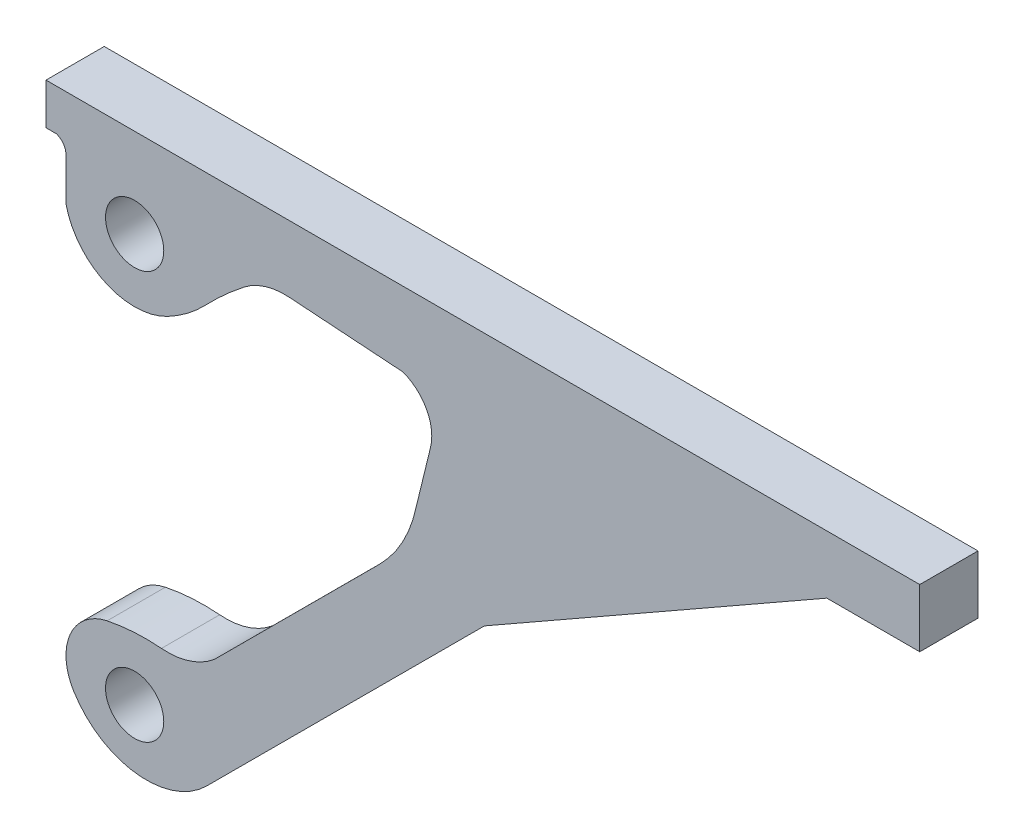
ISO-10303-21;
HEADER;
FILE_DESCRIPTION(('STEP AP214'),'2;1');
FILE_NAME('part.step','',(''),(''),'','','');
FILE_SCHEMA(('AUTOMOTIVE_DESIGN { 1 0 10303 214 1 1 1 1 }'));
ENDSEC;
DATA;
#1=APPLICATION_CONTEXT('core data for automotive mechanical design processes');
#2=APPLICATION_PROTOCOL_DEFINITION('international standard','automotive_design',2000,#1);
#3=PRODUCT_CONTEXT('',#1,'mechanical');
#4=PRODUCT('Part','Part','',(#3));
#5=PRODUCT_RELATED_PRODUCT_CATEGORY('part','',(#4));
#6=PRODUCT_DEFINITION_FORMATION('','',#4);
#7=PRODUCT_DEFINITION_CONTEXT('part definition',#1,'design');
#8=PRODUCT_DEFINITION('design','',#6,#7);
#9=PRODUCT_DEFINITION_SHAPE('','',#8);
#10=(LENGTH_UNIT() NAMED_UNIT(*) SI_UNIT(.MILLI.,.METRE.));
#11=(NAMED_UNIT(*) PLANE_ANGLE_UNIT() SI_UNIT($,.RADIAN.));
#12=(NAMED_UNIT(*) SI_UNIT($,.STERADIAN.) SOLID_ANGLE_UNIT());
#13=UNCERTAINTY_MEASURE_WITH_UNIT(LENGTH_MEASURE(1.E-05),#10,'distance_accuracy_value','');
#14=(GEOMETRIC_REPRESENTATION_CONTEXT(3) GLOBAL_UNCERTAINTY_ASSIGNED_CONTEXT((#13)) GLOBAL_UNIT_ASSIGNED_CONTEXT((#10,
#11,#12)) REPRESENTATION_CONTEXT('',''));
#15=CARTESIAN_POINT('',(0.,0.,0.));
#16=DIRECTION('',(0.,0.,1.));
#17=DIRECTION('',(1.,0.,0.));
#18=AXIS2_PLACEMENT_3D('',#15,#16,#17);
#19=CARTESIAN_POINT('',(34.4534115354379,38.3859663896665,20.));
#20=DIRECTION('',(0.,0.,-1.));
#21=DIRECTION('',(-1.,0.,0.));
#22=AXIS2_PLACEMENT_3D('',#19,#20,#21);
#23=PLANE('',#22);
#24=DIRECTION('',(1.,0.,0.));
#25=VECTOR('',#24,1.);
#26=CARTESIAN_POINT('',(300.,179.99999,20.));
#27=LINE('',#26,#25);
#28=CARTESIAN_POINT('',(268.100984265732,179.99999,20.));
#29=VERTEX_POINT('',#28);
#30=CARTESIAN_POINT('',(300.,179.99999,20.));
#31=VERTEX_POINT('',#30);
#32=EDGE_CURVE('E263',#29,#31,#27,.T.);
#33=ORIENTED_EDGE('',*,*,#32,.T.);
#34=DIRECTION('',(0.,1.,0.));
#35=VECTOR('',#34,1.);
#36=CARTESIAN_POINT('',(300.,200.,20.));
#37=LINE('',#36,#35);
#38=CARTESIAN_POINT('',(300.,200.,20.));
#39=VERTEX_POINT('',#38);
#40=EDGE_CURVE('E141',#31,#39,#37,.T.);
#41=ORIENTED_EDGE('',*,*,#40,.T.);
#42=DIRECTION('',(-1.,0.,0.));
#43=VECTOR('',#42,1.);
#44=CARTESIAN_POINT('',(0.,200.,20.));
#45=LINE('',#44,#43);
#46=CARTESIAN_POINT('',(0.,200.,20.));
#47=VERTEX_POINT('',#46);
#48=EDGE_CURVE('E320',#39,#47,#45,.T.);
#49=ORIENTED_EDGE('',*,*,#48,.T.);
#50=DIRECTION('',(0.,-1.,0.));
#51=VECTOR('',#50,1.);
#52=CARTESIAN_POINT('',(0.,185.815397499551,20.));
#53=LINE('',#52,#51);
#54=CARTESIAN_POINT('',(0.,185.815397499551,20.));
#55=VERTEX_POINT('',#54);
#56=EDGE_CURVE('E339',#47,#55,#53,.T.);
#57=ORIENTED_EDGE('',*,*,#56,.T.);
#58=DIRECTION('',(1.,0.,0.));
#59=VECTOR('',#58,1.);
#60=CARTESIAN_POINT('',(3.56355163998247,185.815397499551,20.));
#61=LINE('',#60,#59);
#62=CARTESIAN_POINT('',(3.56355163998247,185.815397499551,20.));
#63=VERTEX_POINT('',#62);
#64=EDGE_CURVE('E336',#55,#63,#61,.T.);
#65=ORIENTED_EDGE('',*,*,#64,.T.);
#66=CARTESIAN_POINT('',(2.05932351470783,181.256700402745,20.));
#67=DIRECTION('',(0.,0.,-1.));
#68=DIRECTION('',(1.,0.,0.));
#69=AXIS2_PLACEMENT_3D('',#66,#67,#68);
#70=CIRCLE('',#69,4.80046054804071);
#71=CARTESIAN_POINT('',(6.85978406274854,181.256700402745,20.));
#72=VERTEX_POINT('',#71);
#73=EDGE_CURVE('E338',#63,#72,#70,.T.);
#74=ORIENTED_EDGE('',*,*,#73,.T.);
#75=DIRECTION('',(0.,-1.,0.));
#76=VECTOR('',#75,1.);
#77=CARTESIAN_POINT('',(6.85978406274854,166.616485936919,20.));
#78=LINE('',#77,#76);
#79=CARTESIAN_POINT('',(6.85978406274854,166.616485936919,20.));
#80=VERTEX_POINT('',#79);
#81=EDGE_CURVE('E341',#72,#80,#78,.T.);
#82=ORIENTED_EDGE('',*,*,#81,.T.);
#83=CARTESIAN_POINT('',(30.4314304377108,171.952810371003,20.));
#84=DIRECTION('',(0.,0.,1.));
#85=DIRECTION('',(-1.,0.,0.));
#86=AXIS2_PLACEMENT_3D('',#83,#84,#85);
#87=CIRCLE('',#86,24.1681375222021);
#88=CARTESIAN_POINT('',(41.6970062741211,150.570909792099,20.));
#89=VERTEX_POINT('',#88);
#90=EDGE_CURVE('E347',#80,#89,#87,.T.);
#91=ORIENTED_EDGE('',*,*,#90,.T.);
#92=CARTESIAN_POINT('',(18.1590679120298,195.245577576412,20.));
#93=DIRECTION('',(0.,0.,1.));
#94=DIRECTION('',(-1.,0.,0.));
#95=AXIS2_PLACEMENT_3D('',#92,#93,#94);
#96=CIRCLE('',#95,50.4961432584351);
#97=CARTESIAN_POINT('',(54.6413380337197,160.332765447561,20.));
#98=VERTEX_POINT('',#97);
#99=EDGE_CURVE('E349',#89,#98,#96,.T.);
#100=ORIENTED_EDGE('',*,*,#99,.T.);
#101=CARTESIAN_POINT('',(146.53141866213,72.3957727444316,20.));
#102=DIRECTION('',(0.,0.,-1.));
#103=DIRECTION('',(1.,0.,0.));
#104=AXIS2_PLACEMENT_3D('',#101,#102,#103);
#105=CIRCLE('',#104,127.187662937747);
#106=CARTESIAN_POINT('',(67.9798622121405,172.427540612695,20.));
#107=VERTEX_POINT('',#106);
#108=EDGE_CURVE('E351',#98,#107,#105,.T.);
#109=ORIENTED_EDGE('',*,*,#108,.T.);
#110=CARTESIAN_POINT('',(81.9003056222631,154.700500860004,20.));
#111=DIRECTION('',(0.,0.,-1.));
#112=DIRECTION('',(1.,0.,0.));
#113=AXIS2_PLACEMENT_3D('',#110,#111,#112);
#114=CIRCLE('',#113,22.5394472675773);
#115=CARTESIAN_POINT('',(83.453647812116,177.186358886087,20.));
#116=VERTEX_POINT('',#115);
#117=EDGE_CURVE('E353',#107,#116,#114,.T.);
#118=ORIENTED_EDGE('',*,*,#117,.T.);
#119=DIRECTION('',(0.997622424327491,-0.0689166052482316,0.));
#120=VECTOR('',#119,1.);
#121=CARTESIAN_POINT('',(122.461819258154,174.49164123796,20.));
#122=LINE('',#121,#120);
#123=CARTESIAN_POINT('',(122.461819258154,174.49164123796,20.));
#124=VERTEX_POINT('',#123);
#125=EDGE_CURVE('E355',#116,#124,#122,.T.);
#126=ORIENTED_EDGE('',*,*,#125,.T.);
#127=CARTESIAN_POINT('',(117.428727932599,160.332765447561,20.));
#128=DIRECTION('',(0.,0.,-1.));
#129=DIRECTION('',(1.,0.,0.));
#130=AXIS2_PLACEMENT_3D('',#127,#128,#129);
#131=CIRCLE('',#130,15.0268350606279);
#132=CARTESIAN_POINT('',(132.025285125025,156.762570765535,20.));
#133=VERTEX_POINT('',#132);
#134=EDGE_CURVE('E357',#124,#133,#131,.T.);
#135=ORIENTED_EDGE('',*,*,#134,.T.);
#136=DIRECTION('',(-0.237587933029249,-0.97136603506551,0.));
#137=VECTOR('',#136,1.);
#138=CARTESIAN_POINT('',(127.060971476495,136.466229936641,20.));
#139=LINE('',#138,#137);
#140=CARTESIAN_POINT('',(127.060971476495,136.466229936641,20.));
#141=VERTEX_POINT('',#140);
#142=EDGE_CURVE('E359',#133,#141,#139,.T.);
#143=ORIENTED_EDGE('',*,*,#142,.T.);
#144=CARTESIAN_POINT('',(81.7757841195816,146.005688391778,20.));
#145=DIRECTION('',(0.,0.,-1.));
#146=DIRECTION('',(1.,0.,0.));
#147=AXIS2_PLACEMENT_3D('',#144,#145,#146);
#148=CIRCLE('',#147,46.2790391167321);
#149=CARTESIAN_POINT('',(114.485527725598,113.266993628597,20.));
#150=VERTEX_POINT('',#149);
#151=EDGE_CURVE('E361',#141,#150,#148,.T.);
#152=ORIENTED_EDGE('',*,*,#151,.T.);
#153=DIRECTION('',(-0.707419501096423,-0.706793922914231,0.));
#154=VECTOR('',#153,1.);
#155=CARTESIAN_POINT('',(57.9220397468474,56.7535253113535,20.));
#156=LINE('',#155,#154);
#157=CARTESIAN_POINT('',(57.9220397468474,56.7535253113535,20.));
#158=VERTEX_POINT('',#157);
#159=EDGE_CURVE('E363',#150,#158,#156,.T.);
#160=ORIENTED_EDGE('',*,*,#159,.T.);
#161=CARTESIAN_POINT('',(41.6970062741212,75.6365215029275,20.));
#162=DIRECTION('',(0.,0.,-1.));
#163=DIRECTION('',(1.,0.,0.));
#164=AXIS2_PLACEMENT_3D('',#161,#162,#163);
#165=CIRCLE('',#164,24.8961695118362);
#166=CARTESIAN_POINT('',(39.6347272118991,50.8259136620944,20.));
#167=VERTEX_POINT('',#166);
#168=EDGE_CURVE('E365',#158,#167,#165,.T.);
#169=ORIENTED_EDGE('',*,*,#168,.T.);
#170=CARTESIAN_POINT('',(34.2250630428409,-14.2559943627553,20.));
#171=DIRECTION('',(0.,0.,1.));
#172=DIRECTION('',(-1.,0.,0.));
#173=AXIS2_PLACEMENT_3D('',#170,#171,#172);
#174=CIRCLE('',#173,65.3063489913269);
#175=CARTESIAN_POINT('',(20.9690564865726,49.6908390909597,20.));
#176=VERTEX_POINT('',#175);
#177=EDGE_CURVE('E367',#167,#176,#174,.T.);
#178=ORIENTED_EDGE('',*,*,#177,.T.);
#179=CARTESIAN_POINT('',(24.5623586437628,32.3567880236672,20.));
#180=DIRECTION('',(0.,0.,1.));
#181=DIRECTION('',(-1.,0.,0.));
#182=AXIS2_PLACEMENT_3D('',#179,#180,#181);
#183=CIRCLE('',#182,17.7025745810143);
#184=CARTESIAN_POINT('',(9.44664273699618,23.1428703215008,20.));
#185=VERTEX_POINT('',#184);
#186=EDGE_CURVE('E202',#176,#185,#183,.T.);
#187=ORIENTED_EDGE('',*,*,#186,.T.);
#188=CARTESIAN_POINT('',(34.4534115354379,38.3859663896665,20.));
#189=DIRECTION('',(0.,0.,1.));
#190=DIRECTION('',(-1.,0.,0.));
#191=AXIS2_PLACEMENT_3D('',#188,#189,#190);
#192=CIRCLE('',#191,29.2863528538814);
#193=CARTESIAN_POINT('',(55.1528277568831,17.6682292648399,20.));
#194=VERTEX_POINT('',#193);
#195=EDGE_CURVE('E196',#185,#194,#192,.T.);
#196=ORIENTED_EDGE('',*,*,#195,.T.);
#197=DIRECTION('',(0.707419501096423,0.706793922914231,0.));
#198=VECTOR('',#197,1.);
#199=CARTESIAN_POINT('',(150.5376853125,112.96873703125,20.));
#200=LINE('',#199,#198);
#201=CARTESIAN_POINT('',(150.5376853125,112.96873703125,20.));
#202=VERTEX_POINT('',#201);
#203=EDGE_CURVE('E200',#194,#202,#200,.T.);
#204=ORIENTED_EDGE('',*,*,#203,.T.);
#205=DIRECTION('',(0.86871313345835,0.49531554766328,0.));
#206=VECTOR('',#205,1.);
#207=CARTESIAN_POINT('',(268.100984265732,179.99999,20.));
#208=LINE('',#207,#206);
#209=EDGE_CURVE('E56',#202,#29,#208,.T.);
#210=ORIENTED_EDGE('',*,*,#209,.T.);
#211=EDGE_LOOP('',(#33,#41,#49,#57,#65,#74,#82,#91,#100,#109,#118,#126,#135,#143,#152,#160,#169,
#178,#187,#196,#204,#210));
#212=FACE_BOUND('',#211,.T.);
#213=CARTESIAN_POINT('',(30.4314304377108,29.4434585236732,20.));
#214=DIRECTION('',(0.,0.,1.));
#215=DIRECTION('',(1.,0.,0.));
#216=AXIS2_PLACEMENT_3D('',#213,#214,#215);
#217=CIRCLE('',#216,10.);
#218=CARTESIAN_POINT('',(40.4314304377108,29.4434585236732,20.));
#219=VERTEX_POINT('',#218);
#220=EDGE_CURVE('E224',#219,#219,#217,.T.);
#221=ORIENTED_EDGE('',*,*,#220,.F.);
#222=EDGE_LOOP('',(#221));
#223=FACE_BOUND('',#222,.T.);
#224=CARTESIAN_POINT('',(30.4314304377108,169.443458523673,20.));
#225=DIRECTION('',(0.,0.,1.));
#226=DIRECTION('',(1.,0.,0.));
#227=AXIS2_PLACEMENT_3D('',#224,#225,#226);
#228=CIRCLE('',#227,10.);
#229=CARTESIAN_POINT('',(40.4314304377108,169.443458523673,20.));
#230=VERTEX_POINT('',#229);
#231=EDGE_CURVE('E408',#230,#230,#228,.T.);
#232=ORIENTED_EDGE('',*,*,#231,.F.);
#233=EDGE_LOOP('',(#232));
#234=FACE_BOUND('',#233,.T.);
#235=ADVANCED_FACE('F39',(#212,#223,#234),#23,.F.);
#236=CARTESIAN_POINT('',(34.4534115354379,38.3859663896665,0.));
#237=DIRECTION('',(0.,0.,-1.));
#238=DIRECTION('',(-1.,0.,0.));
#239=AXIS2_PLACEMENT_3D('',#236,#237,#238);
#240=PLANE('',#239);
#241=CARTESIAN_POINT('',(30.4314304377108,29.4434585236732,0.));
#242=DIRECTION('',(0.,0.,1.));
#243=DIRECTION('',(1.,0.,0.));
#244=AXIS2_PLACEMENT_3D('',#241,#242,#243);
#245=CIRCLE('',#244,10.);
#246=CARTESIAN_POINT('',(40.4314304377108,29.4434585236732,0.));
#247=VERTEX_POINT('',#246);
#248=EDGE_CURVE('E413',#247,#247,#245,.T.);
#249=ORIENTED_EDGE('',*,*,#248,.T.);
#250=EDGE_LOOP('',(#249));
#251=FACE_BOUND('',#250,.T.);
#252=DIRECTION('',(1.,0.,0.));
#253=VECTOR('',#252,1.);
#254=CARTESIAN_POINT('',(300.,179.99999,0.));
#255=LINE('',#254,#253);
#256=CARTESIAN_POINT('',(268.100984265732,179.99999,0.));
#257=VERTEX_POINT('',#256);
#258=CARTESIAN_POINT('',(300.,179.99999,0.));
#259=VERTEX_POINT('',#258);
#260=EDGE_CURVE('E220',#257,#259,#255,.T.);
#261=ORIENTED_EDGE('',*,*,#260,.F.);
#262=DIRECTION('',(0.86871313345835,0.49531554766328,0.));
#263=VECTOR('',#262,1.);
#264=CARTESIAN_POINT('',(268.100984265732,179.99999,0.));
#265=LINE('',#264,#263);
#266=CARTESIAN_POINT('',(150.5376853125,112.96873703125,0.));
#267=VERTEX_POINT('',#266);
#268=EDGE_CURVE('E133',#267,#257,#265,.T.);
#269=ORIENTED_EDGE('',*,*,#268,.F.);
#270=DIRECTION('',(0.707419501096423,0.706793922914231,0.));
#271=VECTOR('',#270,1.);
#272=CARTESIAN_POINT('',(150.5376853125,112.96873703125,0.));
#273=LINE('',#272,#271);
#274=CARTESIAN_POINT('',(55.1528277568831,17.6682292648399,0.));
#275=VERTEX_POINT('',#274);
#276=EDGE_CURVE('E127',#275,#267,#273,.T.);
#277=ORIENTED_EDGE('',*,*,#276,.F.);
#278=CARTESIAN_POINT('',(34.4534115354379,38.3859663896665,0.));
#279=DIRECTION('',(0.,0.,1.));
#280=DIRECTION('',(-1.,0.,0.));
#281=AXIS2_PLACEMENT_3D('',#278,#279,#280);
#282=CIRCLE('',#281,29.2863528538814);
#283=CARTESIAN_POINT('',(9.44664273699618,23.1428703215008,0.));
#284=VERTEX_POINT('',#283);
#285=EDGE_CURVE('E210',#284,#275,#282,.T.);
#286=ORIENTED_EDGE('',*,*,#285,.F.);
#287=CARTESIAN_POINT('',(24.5623586437628,32.3567880236672,0.));
#288=DIRECTION('',(0.,0.,1.));
#289=DIRECTION('',(-1.,0.,0.));
#290=AXIS2_PLACEMENT_3D('',#287,#288,#289);
#291=CIRCLE('',#290,17.7025745810143);
#292=CARTESIAN_POINT('',(20.9690564865726,49.6908390909597,0.));
#293=VERTEX_POINT('',#292);
#294=EDGE_CURVE('E258',#293,#284,#291,.T.);
#295=ORIENTED_EDGE('',*,*,#294,.F.);
#296=CARTESIAN_POINT('',(34.2250630428409,-14.2559943627553,0.));
#297=DIRECTION('',(0.,0.,1.));
#298=DIRECTION('',(-1.,0.,0.));
#299=AXIS2_PLACEMENT_3D('',#296,#297,#298);
#300=CIRCLE('',#299,65.3063489913269);
#301=CARTESIAN_POINT('',(39.6347272118991,50.8259136620944,0.));
#302=VERTEX_POINT('',#301);
#303=EDGE_CURVE('E256',#302,#293,#300,.T.);
#304=ORIENTED_EDGE('',*,*,#303,.F.);
#305=CARTESIAN_POINT('',(41.6970062741212,75.6365215029275,0.));
#306=DIRECTION('',(0.,0.,-1.));
#307=DIRECTION('',(1.,0.,0.));
#308=AXIS2_PLACEMENT_3D('',#305,#306,#307);
#309=CIRCLE('',#308,24.8961695118362);
#310=CARTESIAN_POINT('',(57.9220397468474,56.7535253113535,0.));
#311=VERTEX_POINT('',#310);
#312=EDGE_CURVE('E254',#311,#302,#309,.T.);
#313=ORIENTED_EDGE('',*,*,#312,.F.);
#314=DIRECTION('',(-0.707419501096423,-0.706793922914231,0.));
#315=VECTOR('',#314,1.);
#316=CARTESIAN_POINT('',(57.9220397468474,56.7535253113535,0.));
#317=LINE('',#316,#315);
#318=CARTESIAN_POINT('',(114.485527725598,113.266993628597,0.));
#319=VERTEX_POINT('',#318);
#320=EDGE_CURVE('E252',#319,#311,#317,.T.);
#321=ORIENTED_EDGE('',*,*,#320,.F.);
#322=CARTESIAN_POINT('',(81.7757841195816,146.005688391778,0.));
#323=DIRECTION('',(0.,0.,-1.));
#324=DIRECTION('',(1.,0.,0.));
#325=AXIS2_PLACEMENT_3D('',#322,#323,#324);
#326=CIRCLE('',#325,46.2790391167321);
#327=CARTESIAN_POINT('',(127.060971476495,136.466229936641,0.));
#328=VERTEX_POINT('',#327);
#329=EDGE_CURVE('E250',#328,#319,#326,.T.);
#330=ORIENTED_EDGE('',*,*,#329,.F.);
#331=DIRECTION('',(-0.237587933029249,-0.97136603506551,0.));
#332=VECTOR('',#331,1.);
#333=CARTESIAN_POINT('',(127.060971476495,136.466229936641,0.));
#334=LINE('',#333,#332);
#335=CARTESIAN_POINT('',(132.025285125025,156.762570765535,0.));
#336=VERTEX_POINT('',#335);
#337=EDGE_CURVE('E248',#336,#328,#334,.T.);
#338=ORIENTED_EDGE('',*,*,#337,.F.);
#339=CARTESIAN_POINT('',(117.428727932599,160.332765447561,0.));
#340=DIRECTION('',(0.,0.,-1.));
#341=DIRECTION('',(1.,0.,0.));
#342=AXIS2_PLACEMENT_3D('',#339,#340,#341);
#343=CIRCLE('',#342,15.0268350606279);
#344=CARTESIAN_POINT('',(122.461819258154,174.49164123796,0.));
#345=VERTEX_POINT('',#344);
#346=EDGE_CURVE('E246',#345,#336,#343,.T.);
#347=ORIENTED_EDGE('',*,*,#346,.F.);
#348=DIRECTION('',(0.997622424327491,-0.0689166052482316,0.));
#349=VECTOR('',#348,1.);
#350=CARTESIAN_POINT('',(122.461819258154,174.49164123796,0.));
#351=LINE('',#350,#349);
#352=CARTESIAN_POINT('',(83.453647812116,177.186358886087,0.));
#353=VERTEX_POINT('',#352);
#354=EDGE_CURVE('E244',#353,#345,#351,.T.);
#355=ORIENTED_EDGE('',*,*,#354,.F.);
#356=CARTESIAN_POINT('',(81.9003056222631,154.700500860004,0.));
#357=DIRECTION('',(0.,0.,-1.));
#358=DIRECTION('',(1.,0.,0.));
#359=AXIS2_PLACEMENT_3D('',#356,#357,#358);
#360=CIRCLE('',#359,22.5394472675773);
#361=CARTESIAN_POINT('',(67.9798622121405,172.427540612695,0.));
#362=VERTEX_POINT('',#361);
#363=EDGE_CURVE('E242',#362,#353,#360,.T.);
#364=ORIENTED_EDGE('',*,*,#363,.F.);
#365=CARTESIAN_POINT('',(146.53141866213,72.3957727444316,0.));
#366=DIRECTION('',(0.,0.,-1.));
#367=DIRECTION('',(1.,0.,0.));
#368=AXIS2_PLACEMENT_3D('',#365,#366,#367);
#369=CIRCLE('',#368,127.187662937747);
#370=CARTESIAN_POINT('',(54.6413380337197,160.332765447561,0.));
#371=VERTEX_POINT('',#370);
#372=EDGE_CURVE('E240',#371,#362,#369,.T.);
#373=ORIENTED_EDGE('',*,*,#372,.F.);
#374=CARTESIAN_POINT('',(18.1590679120298,195.245577576412,0.));
#375=DIRECTION('',(0.,0.,1.));
#376=DIRECTION('',(-1.,0.,0.));
#377=AXIS2_PLACEMENT_3D('',#374,#375,#376);
#378=CIRCLE('',#377,50.4961432584351);
#379=CARTESIAN_POINT('',(41.6970062741211,150.570909792099,0.));
#380=VERTEX_POINT('',#379);
#381=EDGE_CURVE('E238',#380,#371,#378,.T.);
#382=ORIENTED_EDGE('',*,*,#381,.F.);
#383=CARTESIAN_POINT('',(30.4314304377108,171.952810371003,0.));
#384=DIRECTION('',(0.,0.,1.));
#385=DIRECTION('',(-1.,0.,0.));
#386=AXIS2_PLACEMENT_3D('',#383,#384,#385);
#387=CIRCLE('',#386,24.1681375222021);
#388=CARTESIAN_POINT('',(6.85978406274854,166.616485936919,0.));
#389=VERTEX_POINT('',#388);
#390=EDGE_CURVE('E236',#389,#380,#387,.T.);
#391=ORIENTED_EDGE('',*,*,#390,.F.);
#392=DIRECTION('',(0.,-1.,0.));
#393=VECTOR('',#392,1.);
#394=CARTESIAN_POINT('',(6.85978406274854,166.616485936919,0.));
#395=LINE('',#394,#393);
#396=CARTESIAN_POINT('',(6.85978406274854,181.256700402745,0.));
#397=VERTEX_POINT('',#396);
#398=EDGE_CURVE('E234',#397,#389,#395,.T.);
#399=ORIENTED_EDGE('',*,*,#398,.F.);
#400=CARTESIAN_POINT('',(2.05932351470783,181.256700402745,0.));
#401=DIRECTION('',(0.,0.,-1.));
#402=DIRECTION('',(1.,0.,0.));
#403=AXIS2_PLACEMENT_3D('',#400,#401,#402);
#404=CIRCLE('',#403,4.80046054804071);
#405=CARTESIAN_POINT('',(3.56355163998247,185.815397499551,0.));
#406=VERTEX_POINT('',#405);
#407=EDGE_CURVE('E232',#406,#397,#404,.T.);
#408=ORIENTED_EDGE('',*,*,#407,.F.);
#409=DIRECTION('',(1.,0.,0.));
#410=VECTOR('',#409,1.);
#411=CARTESIAN_POINT('',(3.56355163998247,185.815397499551,0.));
#412=LINE('',#411,#410);
#413=CARTESIAN_POINT('',(0.,185.815397499551,0.));
#414=VERTEX_POINT('',#413);
#415=EDGE_CURVE('E230',#414,#406,#412,.T.);
#416=ORIENTED_EDGE('',*,*,#415,.F.);
#417=DIRECTION('',(0.,-1.,0.));
#418=VECTOR('',#417,1.);
#419=CARTESIAN_POINT('',(0.,185.815397499551,0.));
#420=LINE('',#419,#418);
#421=CARTESIAN_POINT('',(0.,200.,0.));
#422=VERTEX_POINT('',#421);
#423=EDGE_CURVE('E228',#422,#414,#420,.T.);
#424=ORIENTED_EDGE('',*,*,#423,.F.);
#425=DIRECTION('',(-1.,0.,0.));
#426=VECTOR('',#425,1.);
#427=CARTESIAN_POINT('',(0.,200.,0.));
#428=LINE('',#427,#426);
#429=CARTESIAN_POINT('',(300.,200.,0.));
#430=VERTEX_POINT('',#429);
#431=EDGE_CURVE('E226',#430,#422,#428,.T.);
#432=ORIENTED_EDGE('',*,*,#431,.F.);
#433=DIRECTION('',(0.,1.,0.));
#434=VECTOR('',#433,1.);
#435=CARTESIAN_POINT('',(300.,200.,0.));
#436=LINE('',#435,#434);
#437=EDGE_CURVE('E223',#259,#430,#436,.T.);
#438=ORIENTED_EDGE('',*,*,#437,.F.);
#439=EDGE_LOOP('',(#261,#269,#277,#286,#295,#304,#313,#321,#330,#338,#347,#355,#364,#373,#382,
#391,#399,#408,#416,#424,#432,#438));
#440=FACE_BOUND('',#439,.T.);
#441=CARTESIAN_POINT('',(30.4314304377108,169.443458523673,0.));
#442=DIRECTION('',(0.,0.,1.));
#443=DIRECTION('',(1.,0.,0.));
#444=AXIS2_PLACEMENT_3D('',#441,#442,#443);
#445=CIRCLE('',#444,10.);
#446=CARTESIAN_POINT('',(40.4314304377108,169.443458523673,0.));
#447=VERTEX_POINT('',#446);
#448=EDGE_CURVE('E411',#447,#447,#445,.T.);
#449=ORIENTED_EDGE('',*,*,#448,.T.);
#450=EDGE_LOOP('',(#449));
#451=FACE_BOUND('',#450,.T.);
#452=ADVANCED_FACE('F324',(#251,#440,#451),#240,.T.);
#453=CARTESIAN_POINT('',(300.,179.99999,20.));
#454=DIRECTION('',(0.,1.,0.));
#455=DIRECTION('',(0.,0.,1.));
#456=AXIS2_PLACEMENT_3D('',#453,#454,#455);
#457=PLANE('',#456);
#458=ORIENTED_EDGE('',*,*,#260,.T.);
#459=DIRECTION('',(0.,0.,-1.));
#460=VECTOR('',#459,1.);
#461=CARTESIAN_POINT('',(300.,179.99999,20.));
#462=LINE('',#461,#460);
#463=EDGE_CURVE('E11',#31,#259,#462,.T.);
#464=ORIENTED_EDGE('',*,*,#463,.F.);
#465=ORIENTED_EDGE('',*,*,#32,.F.);
#466=DIRECTION('',(0.,0.,-1.));
#467=VECTOR('',#466,1.);
#468=CARTESIAN_POINT('',(268.100984265732,179.99999,20.));
#469=LINE('',#468,#467);
#470=EDGE_CURVE('E216',#29,#257,#469,.T.);
#471=ORIENTED_EDGE('',*,*,#470,.T.);
#472=EDGE_LOOP('',(#458,#464,#465,#471));
#473=FACE_BOUND('',#472,.T.);
#474=ADVANCED_FACE('F41',(#473),#457,.F.);
#475=CARTESIAN_POINT('',(300.,200.,20.));
#476=DIRECTION('',(-1.,0.,0.));
#477=DIRECTION('',(0.,0.,1.));
#478=AXIS2_PLACEMENT_3D('',#475,#476,#477);
#479=PLANE('',#478);
#480=ORIENTED_EDGE('',*,*,#437,.T.);
#481=DIRECTION('',(0.,0.,-1.));
#482=VECTOR('',#481,1.);
#483=CARTESIAN_POINT('',(300.,200.,20.));
#484=LINE('',#483,#482);
#485=EDGE_CURVE('E48',#39,#430,#484,.T.);
#486=ORIENTED_EDGE('',*,*,#485,.F.);
#487=ORIENTED_EDGE('',*,*,#40,.F.);
#488=ORIENTED_EDGE('',*,*,#463,.T.);
#489=EDGE_LOOP('',(#480,#486,#487,#488));
#490=FACE_BOUND('',#489,.T.);
#491=ADVANCED_FACE('F434',(#490),#479,.F.);
#492=CARTESIAN_POINT('',(0.,200.,20.));
#493=DIRECTION('',(0.,-1.,0.));
#494=DIRECTION('',(0.,0.,-1.));
#495=AXIS2_PLACEMENT_3D('',#492,#493,#494);
#496=PLANE('',#495);
#497=ORIENTED_EDGE('',*,*,#431,.T.);
#498=DIRECTION('',(0.,0.,-1.));
#499=VECTOR('',#498,1.);
#500=CARTESIAN_POINT('',(0.,200.,20.));
#501=LINE('',#500,#499);
#502=EDGE_CURVE('E312',#47,#422,#501,.T.);
#503=ORIENTED_EDGE('',*,*,#502,.F.);
#504=ORIENTED_EDGE('',*,*,#48,.F.);
#505=ORIENTED_EDGE('',*,*,#485,.T.);
#506=EDGE_LOOP('',(#497,#503,#504,#505));
#507=FACE_BOUND('',#506,.T.);
#508=ADVANCED_FACE('F318',(#507),#496,.F.);
#509=CARTESIAN_POINT('',(0.,185.815397499551,20.));
#510=DIRECTION('',(1.,0.,0.));
#511=DIRECTION('',(0.,0.,-1.));
#512=AXIS2_PLACEMENT_3D('',#509,#510,#511);
#513=PLANE('',#512);
#514=ORIENTED_EDGE('',*,*,#423,.T.);
#515=DIRECTION('',(0.,0.,-1.));
#516=VECTOR('',#515,1.);
#517=CARTESIAN_POINT('',(0.,185.815397499551,20.));
#518=LINE('',#517,#516);
#519=EDGE_CURVE('E309',#55,#414,#518,.T.);
#520=ORIENTED_EDGE('',*,*,#519,.F.);
#521=ORIENTED_EDGE('',*,*,#56,.F.);
#522=ORIENTED_EDGE('',*,*,#502,.T.);
#523=EDGE_LOOP('',(#514,#520,#521,#522));
#524=FACE_BOUND('',#523,.T.);
#525=ADVANCED_FACE('F330',(#524),#513,.F.);
#526=CARTESIAN_POINT('',(3.56355163998247,185.815397499551,20.));
#527=DIRECTION('',(0.,1.,0.));
#528=DIRECTION('',(0.,0.,1.));
#529=AXIS2_PLACEMENT_3D('',#526,#527,#528);
#530=PLANE('',#529);
#531=ORIENTED_EDGE('',*,*,#415,.T.);
#532=DIRECTION('',(0.,0.,-1.));
#533=VECTOR('',#532,1.);
#534=CARTESIAN_POINT('',(3.56355163998247,185.815397499551,20.));
#535=LINE('',#534,#533);
#536=EDGE_CURVE('E306',#63,#406,#535,.T.);
#537=ORIENTED_EDGE('',*,*,#536,.F.);
#538=ORIENTED_EDGE('',*,*,#64,.F.);
#539=ORIENTED_EDGE('',*,*,#519,.T.);
#540=EDGE_LOOP('',(#531,#537,#538,#539));
#541=FACE_BOUND('',#540,.T.);
#542=ADVANCED_FACE('F334',(#541),#530,.F.);
#543=CARTESIAN_POINT('',(2.05932351470783,181.256700402745,20.));
#544=DIRECTION('',(0.,0.,-1.));
#545=DIRECTION('',(-1.,0.,0.));
#546=AXIS2_PLACEMENT_3D('',#543,#544,#545);
#547=CYLINDRICAL_SURFACE('',#546,4.80046054804071);
#548=ORIENTED_EDGE('',*,*,#407,.T.);
#549=DIRECTION('',(0.,0.,-1.));
#550=VECTOR('',#549,1.);
#551=CARTESIAN_POINT('',(6.85978406274854,181.256700402745,20.));
#552=LINE('',#551,#550);
#553=EDGE_CURVE('E303',#72,#397,#552,.T.);
#554=ORIENTED_EDGE('',*,*,#553,.F.);
#555=ORIENTED_EDGE('',*,*,#73,.F.);
#556=ORIENTED_EDGE('',*,*,#536,.T.);
#557=EDGE_LOOP('',(#548,#554,#555,#556));
#558=FACE_BOUND('',#557,.T.);
#559=ADVANCED_FACE('F453',(#558),#547,.F.);
#560=CARTESIAN_POINT('',(6.85978406274854,166.616485936919,20.));
#561=DIRECTION('',(1.,0.,0.));
#562=DIRECTION('',(0.,0.,-1.));
#563=AXIS2_PLACEMENT_3D('',#560,#561,#562);
#564=PLANE('',#563);
#565=ORIENTED_EDGE('',*,*,#398,.T.);
#566=DIRECTION('',(0.,0.,-1.));
#567=VECTOR('',#566,1.);
#568=CARTESIAN_POINT('',(6.85978406274854,166.616485936919,20.));
#569=LINE('',#568,#567);
#570=EDGE_CURVE('E300',#80,#389,#569,.T.);
#571=ORIENTED_EDGE('',*,*,#570,.F.);
#572=ORIENTED_EDGE('',*,*,#81,.F.);
#573=ORIENTED_EDGE('',*,*,#553,.T.);
#574=EDGE_LOOP('',(#565,#571,#572,#573));
#575=FACE_BOUND('',#574,.T.);
#576=ADVANCED_FACE('F460',(#575),#564,.F.);
#577=CARTESIAN_POINT('',(30.4314304377108,171.952810371003,20.));
#578=DIRECTION('',(0.,0.,-1.));
#579=DIRECTION('',(-1.,0.,0.));
#580=AXIS2_PLACEMENT_3D('',#577,#578,#579);
#581=CYLINDRICAL_SURFACE('',#580,24.1681375222021);
#582=ORIENTED_EDGE('',*,*,#390,.T.);
#583=DIRECTION('',(0.,0.,-1.));
#584=VECTOR('',#583,1.);
#585=CARTESIAN_POINT('',(41.6970062741211,150.570909792099,20.));
#586=LINE('',#585,#584);
#587=EDGE_CURVE('E297',#89,#380,#586,.T.);
#588=ORIENTED_EDGE('',*,*,#587,.F.);
#589=ORIENTED_EDGE('',*,*,#90,.F.);
#590=ORIENTED_EDGE('',*,*,#570,.T.);
#591=EDGE_LOOP('',(#582,#588,#589,#590));
#592=FACE_BOUND('',#591,.T.);
#593=ADVANCED_FACE('F468',(#592),#581,.T.);
#594=CARTESIAN_POINT('',(18.1590679120298,195.245577576412,20.));
#595=DIRECTION('',(0.,0.,-1.));
#596=DIRECTION('',(-1.,0.,0.));
#597=AXIS2_PLACEMENT_3D('',#594,#595,#596);
#598=CYLINDRICAL_SURFACE('',#597,50.4961432584351);
#599=ORIENTED_EDGE('',*,*,#381,.T.);
#600=DIRECTION('',(0.,0.,-1.));
#601=VECTOR('',#600,1.);
#602=CARTESIAN_POINT('',(54.6413380337197,160.332765447561,20.));
#603=LINE('',#602,#601);
#604=EDGE_CURVE('E294',#98,#371,#603,.T.);
#605=ORIENTED_EDGE('',*,*,#604,.F.);
#606=ORIENTED_EDGE('',*,*,#99,.F.);
#607=ORIENTED_EDGE('',*,*,#587,.T.);
#608=EDGE_LOOP('',(#599,#605,#606,#607));
#609=FACE_BOUND('',#608,.T.);
#610=ADVANCED_FACE('F476',(#609),#598,.T.);
#611=CARTESIAN_POINT('',(146.53141866213,72.3957727444316,20.));
#612=DIRECTION('',(0.,0.,-1.));
#613=DIRECTION('',(-1.,0.,0.));
#614=AXIS2_PLACEMENT_3D('',#611,#612,#613);
#615=CYLINDRICAL_SURFACE('',#614,127.187662937747);
#616=ORIENTED_EDGE('',*,*,#372,.T.);
#617=DIRECTION('',(0.,0.,-1.));
#618=VECTOR('',#617,1.);
#619=CARTESIAN_POINT('',(67.9798622121405,172.427540612695,20.));
#620=LINE('',#619,#618);
#621=EDGE_CURVE('E291',#107,#362,#620,.T.);
#622=ORIENTED_EDGE('',*,*,#621,.F.);
#623=ORIENTED_EDGE('',*,*,#108,.F.);
#624=ORIENTED_EDGE('',*,*,#604,.T.);
#625=EDGE_LOOP('',(#616,#622,#623,#624));
#626=FACE_BOUND('',#625,.T.);
#627=ADVANCED_FACE('F484',(#626),#615,.F.);
#628=CARTESIAN_POINT('',(81.9003056222631,154.700500860004,20.));
#629=DIRECTION('',(0.,0.,-1.));
#630=DIRECTION('',(-1.,0.,0.));
#631=AXIS2_PLACEMENT_3D('',#628,#629,#630);
#632=CYLINDRICAL_SURFACE('',#631,22.5394472675773);
#633=ORIENTED_EDGE('',*,*,#363,.T.);
#634=DIRECTION('',(0.,0.,-1.));
#635=VECTOR('',#634,1.);
#636=CARTESIAN_POINT('',(83.453647812116,177.186358886087,20.));
#637=LINE('',#636,#635);
#638=EDGE_CURVE('E288',#116,#353,#637,.T.);
#639=ORIENTED_EDGE('',*,*,#638,.F.);
#640=ORIENTED_EDGE('',*,*,#117,.F.);
#641=ORIENTED_EDGE('',*,*,#621,.T.);
#642=EDGE_LOOP('',(#633,#639,#640,#641));
#643=FACE_BOUND('',#642,.T.);
#644=ADVANCED_FACE('F492',(#643),#632,.F.);
#645=CARTESIAN_POINT('',(122.461819258154,174.49164123796,20.));
#646=DIRECTION('',(0.0689166052482316,0.99762242432749,0.));
#647=DIRECTION('',(-0.99762242432749,0.0689166052482316,0.));
#648=AXIS2_PLACEMENT_3D('',#645,#646,#647);
#649=PLANE('',#648);
#650=ORIENTED_EDGE('',*,*,#354,.T.);
#651=DIRECTION('',(0.,0.,-1.));
#652=VECTOR('',#651,1.);
#653=CARTESIAN_POINT('',(122.461819258154,174.49164123796,20.));
#654=LINE('',#653,#652);
#655=EDGE_CURVE('E285',#124,#345,#654,.T.);
#656=ORIENTED_EDGE('',*,*,#655,.F.);
#657=ORIENTED_EDGE('',*,*,#125,.F.);
#658=ORIENTED_EDGE('',*,*,#638,.T.);
#659=EDGE_LOOP('',(#650,#656,#657,#658));
#660=FACE_BOUND('',#659,.T.);
#661=ADVANCED_FACE('F500',(#660),#649,.F.);
#662=CARTESIAN_POINT('',(117.428727932599,160.332765447561,20.));
#663=DIRECTION('',(0.,0.,-1.));
#664=DIRECTION('',(-1.,0.,0.));
#665=AXIS2_PLACEMENT_3D('',#662,#663,#664);
#666=CYLINDRICAL_SURFACE('',#665,15.0268350606279);
#667=ORIENTED_EDGE('',*,*,#346,.T.);
#668=DIRECTION('',(0.,0.,-1.));
#669=VECTOR('',#668,1.);
#670=CARTESIAN_POINT('',(132.025285125025,156.762570765535,20.));
#671=LINE('',#670,#669);
#672=EDGE_CURVE('E282',#133,#336,#671,.T.);
#673=ORIENTED_EDGE('',*,*,#672,.F.);
#674=ORIENTED_EDGE('',*,*,#134,.F.);
#675=ORIENTED_EDGE('',*,*,#655,.T.);
#676=EDGE_LOOP('',(#667,#673,#674,#675));
#677=FACE_BOUND('',#676,.T.);
#678=ADVANCED_FACE('F508',(#677),#666,.F.);
#679=CARTESIAN_POINT('',(127.060971476495,136.466229936641,20.));
#680=DIRECTION('',(0.97136603506551,-0.237587933029249,0.));
#681=DIRECTION('',(0.237587933029249,0.97136603506551,0.));
#682=AXIS2_PLACEMENT_3D('',#679,#680,#681);
#683=PLANE('',#682);
#684=ORIENTED_EDGE('',*,*,#337,.T.);
#685=DIRECTION('',(0.,0.,-1.));
#686=VECTOR('',#685,1.);
#687=CARTESIAN_POINT('',(127.060971476495,136.466229936641,20.));
#688=LINE('',#687,#686);
#689=EDGE_CURVE('E279',#141,#328,#688,.T.);
#690=ORIENTED_EDGE('',*,*,#689,.F.);
#691=ORIENTED_EDGE('',*,*,#142,.F.);
#692=ORIENTED_EDGE('',*,*,#672,.T.);
#693=EDGE_LOOP('',(#684,#690,#691,#692));
#694=FACE_BOUND('',#693,.T.);
#695=ADVANCED_FACE('F516',(#694),#683,.F.);
#696=CARTESIAN_POINT('',(81.7757841195816,146.005688391778,20.));
#697=DIRECTION('',(0.,0.,-1.));
#698=DIRECTION('',(-1.,0.,0.));
#699=AXIS2_PLACEMENT_3D('',#696,#697,#698);
#700=CYLINDRICAL_SURFACE('',#699,46.2790391167321);
#701=ORIENTED_EDGE('',*,*,#329,.T.);
#702=DIRECTION('',(0.,0.,-1.));
#703=VECTOR('',#702,1.);
#704=CARTESIAN_POINT('',(114.485527725598,113.266993628597,20.));
#705=LINE('',#704,#703);
#706=EDGE_CURVE('E276',#150,#319,#705,.T.);
#707=ORIENTED_EDGE('',*,*,#706,.F.);
#708=ORIENTED_EDGE('',*,*,#151,.F.);
#709=ORIENTED_EDGE('',*,*,#689,.T.);
#710=EDGE_LOOP('',(#701,#707,#708,#709));
#711=FACE_BOUND('',#710,.T.);
#712=ADVANCED_FACE('F524',(#711),#700,.F.);
#713=CARTESIAN_POINT('',(57.9220397468474,56.7535253113535,20.));
#714=DIRECTION('',(0.706793922914231,-0.707419501096423,0.));
#715=DIRECTION('',(0.707419501096423,0.706793922914231,0.));
#716=AXIS2_PLACEMENT_3D('',#713,#714,#715);
#717=PLANE('',#716);
#718=ORIENTED_EDGE('',*,*,#320,.T.);
#719=DIRECTION('',(0.,0.,-1.));
#720=VECTOR('',#719,1.);
#721=CARTESIAN_POINT('',(57.9220397468474,56.7535253113535,20.));
#722=LINE('',#721,#720);
#723=EDGE_CURVE('E273',#158,#311,#722,.T.);
#724=ORIENTED_EDGE('',*,*,#723,.F.);
#725=ORIENTED_EDGE('',*,*,#159,.F.);
#726=ORIENTED_EDGE('',*,*,#706,.T.);
#727=EDGE_LOOP('',(#718,#724,#725,#726));
#728=FACE_BOUND('',#727,.T.);
#729=ADVANCED_FACE('F532',(#728),#717,.F.);
#730=CARTESIAN_POINT('',(41.6970062741212,75.6365215029275,20.));
#731=DIRECTION('',(0.,0.,-1.));
#732=DIRECTION('',(-1.,0.,0.));
#733=AXIS2_PLACEMENT_3D('',#730,#731,#732);
#734=CYLINDRICAL_SURFACE('',#733,24.8961695118362);
#735=ORIENTED_EDGE('',*,*,#312,.T.);
#736=DIRECTION('',(0.,0.,-1.));
#737=VECTOR('',#736,1.);
#738=CARTESIAN_POINT('',(39.6347272118991,50.8259136620944,20.));
#739=LINE('',#738,#737);
#740=EDGE_CURVE('E270',#167,#302,#739,.T.);
#741=ORIENTED_EDGE('',*,*,#740,.F.);
#742=ORIENTED_EDGE('',*,*,#168,.F.);
#743=ORIENTED_EDGE('',*,*,#723,.T.);
#744=EDGE_LOOP('',(#735,#741,#742,#743));
#745=FACE_BOUND('',#744,.T.);
#746=ADVANCED_FACE('F540',(#745),#734,.F.);
#747=CARTESIAN_POINT('',(34.2250630428409,-14.2559943627553,20.));
#748=DIRECTION('',(0.,0.,-1.));
#749=DIRECTION('',(-1.,0.,0.));
#750=AXIS2_PLACEMENT_3D('',#747,#748,#749);
#751=CYLINDRICAL_SURFACE('',#750,65.3063489913269);
#752=ORIENTED_EDGE('',*,*,#303,.T.);
#753=DIRECTION('',(0.,0.,-1.));
#754=VECTOR('',#753,1.);
#755=CARTESIAN_POINT('',(20.9690564865726,49.6908390909597,20.));
#756=LINE('',#755,#754);
#757=EDGE_CURVE('E267',#176,#293,#756,.T.);
#758=ORIENTED_EDGE('',*,*,#757,.F.);
#759=ORIENTED_EDGE('',*,*,#177,.F.);
#760=ORIENTED_EDGE('',*,*,#740,.T.);
#761=EDGE_LOOP('',(#752,#758,#759,#760));
#762=FACE_BOUND('',#761,.T.);
#763=ADVANCED_FACE('F373',(#762),#751,.T.);
#764=CARTESIAN_POINT('',(24.5623586437628,32.3567880236672,20.));
#765=DIRECTION('',(0.,0.,-1.));
#766=DIRECTION('',(-1.,0.,0.));
#767=AXIS2_PLACEMENT_3D('',#764,#765,#766);
#768=CYLINDRICAL_SURFACE('',#767,17.7025745810143);
#769=ORIENTED_EDGE('',*,*,#294,.T.);
#770=DIRECTION('',(0.,0.,-1.));
#771=VECTOR('',#770,1.);
#772=CARTESIAN_POINT('',(9.44664273699618,23.1428703215008,20.));
#773=LINE('',#772,#771);
#774=EDGE_CURVE('E211',#185,#284,#773,.T.);
#775=ORIENTED_EDGE('',*,*,#774,.F.);
#776=ORIENTED_EDGE('',*,*,#186,.F.);
#777=ORIENTED_EDGE('',*,*,#757,.T.);
#778=EDGE_LOOP('',(#769,#775,#776,#777));
#779=FACE_BOUND('',#778,.T.);
#780=ADVANCED_FACE('F377',(#779),#768,.T.);
#781=CARTESIAN_POINT('',(34.4534115354379,38.3859663896665,20.));
#782=DIRECTION('',(0.,0.,-1.));
#783=DIRECTION('',(-1.,0.,0.));
#784=AXIS2_PLACEMENT_3D('',#781,#782,#783);
#785=CYLINDRICAL_SURFACE('',#784,29.2863528538814);
#786=ORIENTED_EDGE('',*,*,#285,.T.);
#787=DIRECTION('',(0.,0.,-1.));
#788=VECTOR('',#787,1.);
#789=CARTESIAN_POINT('',(55.1528277568831,17.6682292648399,20.));
#790=LINE('',#789,#788);
#791=EDGE_CURVE('E207',#194,#275,#790,.T.);
#792=ORIENTED_EDGE('',*,*,#791,.F.);
#793=ORIENTED_EDGE('',*,*,#195,.F.);
#794=ORIENTED_EDGE('',*,*,#774,.T.);
#795=EDGE_LOOP('',(#786,#792,#793,#794));
#796=FACE_BOUND('',#795,.T.);
#797=ADVANCED_FACE('F208',(#796),#785,.T.);
#798=CARTESIAN_POINT('',(150.5376853125,112.96873703125,20.));
#799=DIRECTION('',(-0.706793922914231,0.707419501096423,0.));
#800=DIRECTION('',(-0.707419501096423,-0.706793922914231,0.));
#801=AXIS2_PLACEMENT_3D('',#798,#799,#800);
#802=PLANE('',#801);
#803=ORIENTED_EDGE('',*,*,#276,.T.);
#804=DIRECTION('',(0.,0.,-1.));
#805=VECTOR('',#804,1.);
#806=CARTESIAN_POINT('',(150.5376853125,112.96873703125,20.));
#807=LINE('',#806,#805);
#808=EDGE_CURVE('E212',#202,#267,#807,.T.);
#809=ORIENTED_EDGE('',*,*,#808,.F.);
#810=ORIENTED_EDGE('',*,*,#203,.F.);
#811=ORIENTED_EDGE('',*,*,#791,.T.);
#812=EDGE_LOOP('',(#803,#809,#810,#811));
#813=FACE_BOUND('',#812,.T.);
#814=ADVANCED_FACE('F214',(#813),#802,.F.);
#815=CARTESIAN_POINT('',(268.100984265732,179.99999,20.));
#816=DIRECTION('',(-0.49531554766328,0.86871313345835,0.));
#817=DIRECTION('',(-0.86871313345835,-0.49531554766328,0.));
#818=AXIS2_PLACEMENT_3D('',#815,#816,#817);
#819=PLANE('',#818);
#820=ORIENTED_EDGE('',*,*,#268,.T.);
#821=ORIENTED_EDGE('',*,*,#470,.F.);
#822=ORIENTED_EDGE('',*,*,#209,.F.);
#823=ORIENTED_EDGE('',*,*,#808,.T.);
#824=EDGE_LOOP('',(#820,#821,#822,#823));
#825=FACE_BOUND('',#824,.T.);
#826=ADVANCED_FACE('F381',(#825),#819,.F.);
#827=CARTESIAN_POINT('',(30.4314304377108,29.4434585236732,20.));
#828=DIRECTION('',(0.,0.,-1.));
#829=DIRECTION('',(-1.,0.,0.));
#830=AXIS2_PLACEMENT_3D('',#827,#828,#829);
#831=CYLINDRICAL_SURFACE('',#830,10.);
#832=ORIENTED_EDGE('',*,*,#220,.T.);
#833=EDGE_LOOP('',(#832));
#834=FACE_BOUND('',#833,.T.);
#835=ORIENTED_EDGE('',*,*,#248,.F.);
#836=EDGE_LOOP('',(#835));
#837=FACE_BOUND('',#836,.T.);
#838=ADVANCED_FACE('F383',(#834,#837),#831,.F.);
#839=CARTESIAN_POINT('',(30.4314304377108,169.443458523673,20.));
#840=DIRECTION('',(0.,0.,-1.));
#841=DIRECTION('',(-1.,0.,0.));
#842=AXIS2_PLACEMENT_3D('',#839,#840,#841);
#843=CYLINDRICAL_SURFACE('',#842,10.);
#844=ORIENTED_EDGE('',*,*,#231,.T.);
#845=EDGE_LOOP('',(#844));
#846=FACE_BOUND('',#845,.T.);
#847=ORIENTED_EDGE('',*,*,#448,.F.);
#848=EDGE_LOOP('',(#847));
#849=FACE_BOUND('',#848,.T.);
#850=ADVANCED_FACE('F389',(#846,#849),#843,.F.);
#851=CLOSED_SHELL('',(#235,#452,#474,#491,#508,#525,#542,#559,#576,#593,#610,#627,#644,#661,
#678,#695,#712,#729,#746,#763,#780,#797,#814,#826,#838,#850));
#852=MANIFOLD_SOLID_BREP('B2',#851);
#853=ADVANCED_BREP_SHAPE_REPRESENTATION('',(#18,#852),#14);
#854=SHAPE_DEFINITION_REPRESENTATION(#9,#853);
ENDSEC;
END-ISO-10303-21;
